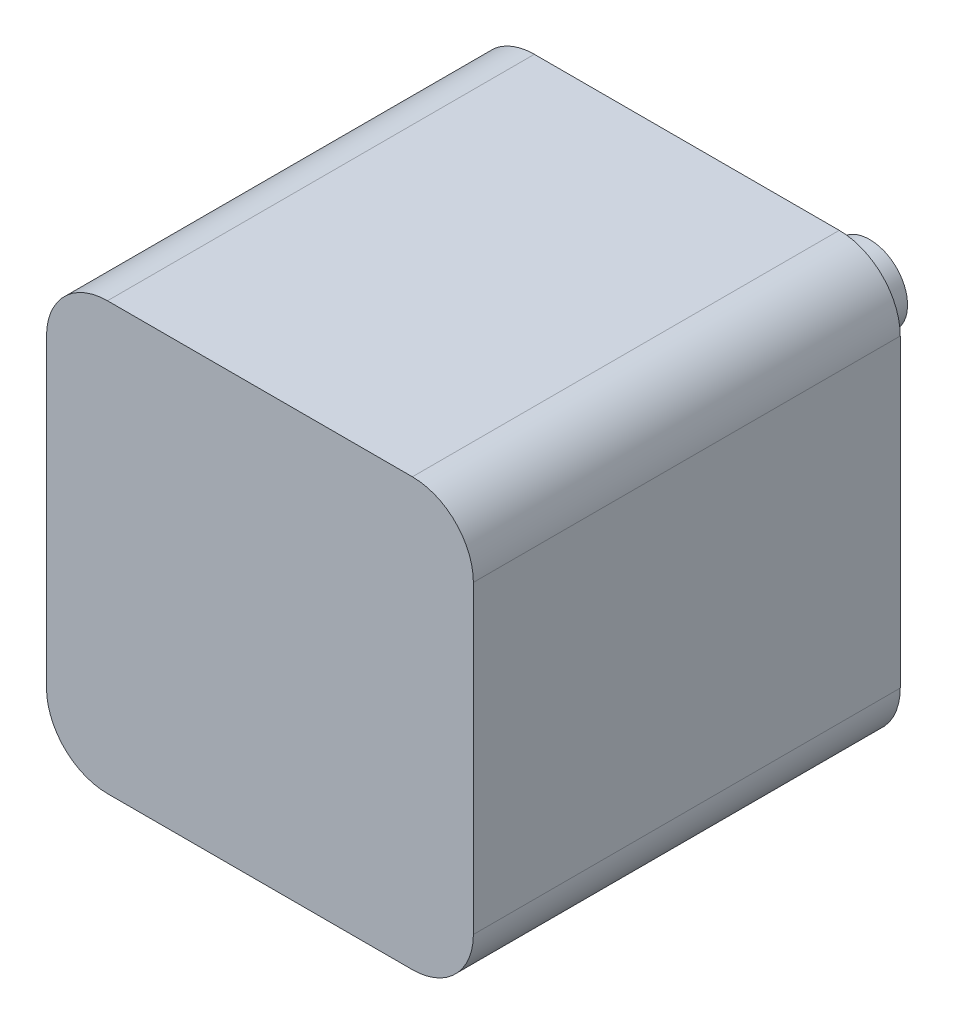
ISO-10303-21;
HEADER;
FILE_DESCRIPTION(('STEP AP214'),'2;1');
FILE_NAME('part.step','',(''),(''),'','','');
FILE_SCHEMA(('AUTOMOTIVE_DESIGN { 1 0 10303 214 1 1 1 1 }'));
ENDSEC;
DATA;
#1=APPLICATION_CONTEXT('core data for automotive mechanical design processes');
#2=APPLICATION_PROTOCOL_DEFINITION('international standard','automotive_design',2000,#1);
#3=PRODUCT_CONTEXT('',#1,'mechanical');
#4=PRODUCT('Part','Part','',(#3));
#5=PRODUCT_RELATED_PRODUCT_CATEGORY('part','',(#4));
#6=PRODUCT_DEFINITION_FORMATION('','',#4);
#7=PRODUCT_DEFINITION_CONTEXT('part definition',#1,'design');
#8=PRODUCT_DEFINITION('design','',#6,#7);
#9=PRODUCT_DEFINITION_SHAPE('','',#8);
#10=(LENGTH_UNIT() NAMED_UNIT(*) SI_UNIT(.MILLI.,.METRE.));
#11=(NAMED_UNIT(*) PLANE_ANGLE_UNIT() SI_UNIT($,.RADIAN.));
#12=(NAMED_UNIT(*) SI_UNIT($,.STERADIAN.) SOLID_ANGLE_UNIT());
#13=UNCERTAINTY_MEASURE_WITH_UNIT(LENGTH_MEASURE(1.E-05),#10,'distance_accuracy_value','');
#14=(GEOMETRIC_REPRESENTATION_CONTEXT(3) GLOBAL_UNCERTAINTY_ASSIGNED_CONTEXT((#13)) GLOBAL_UNIT_ASSIGNED_CONTEXT((#10,
#11,#12)) REPRESENTATION_CONTEXT('',''));
#15=CARTESIAN_POINT('',(0.,0.,0.));
#16=DIRECTION('',(0.,0.,1.));
#17=DIRECTION('',(1.,0.,0.));
#18=AXIS2_PLACEMENT_3D('',#15,#16,#17);
#19=CARTESIAN_POINT('',(8.89,-8.89,17.78));
#20=DIRECTION('',(-1.,0.,0.));
#21=DIRECTION('',(0.,0.,1.));
#22=AXIS2_PLACEMENT_3D('',#19,#20,#21);
#23=PLANE('',#22);
#24=DIRECTION('',(0.,1.,0.));
#25=VECTOR('',#24,1.);
#26=CARTESIAN_POINT('',(8.89,-8.89,17.78));
#27=LINE('',#26,#25);
#28=CARTESIAN_POINT('',(8.89,-6.35,17.78));
#29=VERTEX_POINT('',#28);
#30=CARTESIAN_POINT('',(8.89,6.34999999999999,17.78));
#31=VERTEX_POINT('',#30);
#32=EDGE_CURVE('E126',#29,#31,#27,.T.);
#33=ORIENTED_EDGE('',*,*,#32,.F.);
#34=DIRECTION('',(0.,0.,-1.));
#35=VECTOR('',#34,1.);
#36=CARTESIAN_POINT('',(8.89,-6.35,17.78));
#37=LINE('',#36,#35);
#38=CARTESIAN_POINT('',(8.89,-6.35,0.));
#39=VERTEX_POINT('',#38);
#40=EDGE_CURVE('E110',#29,#39,#37,.T.);
#41=ORIENTED_EDGE('',*,*,#40,.T.);
#42=DIRECTION('',(0.,1.,0.));
#43=VECTOR('',#42,1.);
#44=CARTESIAN_POINT('',(8.89,-8.89,0.));
#45=LINE('',#44,#43);
#46=CARTESIAN_POINT('',(8.89,6.34999999999999,0.));
#47=VERTEX_POINT('',#46);
#48=EDGE_CURVE('E123',#39,#47,#45,.T.);
#49=ORIENTED_EDGE('',*,*,#48,.T.);
#50=DIRECTION('',(0.,0.,-1.));
#51=VECTOR('',#50,1.);
#52=CARTESIAN_POINT('',(8.89,6.34999999999999,17.78));
#53=LINE('',#52,#51);
#54=EDGE_CURVE('E129',#47,#31,#53,.F.);
#55=ORIENTED_EDGE('',*,*,#54,.T.);
#56=EDGE_LOOP('',(#33,#41,#49,#55));
#57=FACE_BOUND('',#56,.T.);
#58=ADVANCED_FACE('F39',(#57),#23,.F.);
#59=CARTESIAN_POINT('',(-8.89,8.89,17.78));
#60=DIRECTION('',(0.,-1.,0.));
#61=DIRECTION('',(0.,0.,-1.));
#62=AXIS2_PLACEMENT_3D('',#59,#60,#61);
#63=PLANE('',#62);
#64=DIRECTION('',(-1.,0.,0.));
#65=VECTOR('',#64,1.);
#66=CARTESIAN_POINT('',(-8.89,8.89,0.));
#67=LINE('',#66,#65);
#68=CARTESIAN_POINT('',(6.35,8.89,0.));
#69=VERTEX_POINT('',#68);
#70=CARTESIAN_POINT('',(-6.35,8.89,0.));
#71=VERTEX_POINT('',#70);
#72=EDGE_CURVE('E134',#69,#71,#67,.T.);
#73=ORIENTED_EDGE('',*,*,#72,.T.);
#74=DIRECTION('',(0.,0.,-1.));
#75=VECTOR('',#74,1.);
#76=CARTESIAN_POINT('',(-6.35,8.89,17.78));
#77=LINE('',#76,#75);
#78=CARTESIAN_POINT('',(-6.35,8.89,17.78));
#79=VERTEX_POINT('',#78);
#80=EDGE_CURVE('E11',#71,#79,#77,.F.);
#81=ORIENTED_EDGE('',*,*,#80,.T.);
#82=DIRECTION('',(-1.,0.,0.));
#83=VECTOR('',#82,1.);
#84=CARTESIAN_POINT('',(-8.89,8.89,17.78));
#85=LINE('',#84,#83);
#86=CARTESIAN_POINT('',(6.35,8.89,17.78));
#87=VERTEX_POINT('',#86);
#88=EDGE_CURVE('E191',#87,#79,#85,.T.);
#89=ORIENTED_EDGE('',*,*,#88,.F.);
#90=DIRECTION('',(0.,0.,-1.));
#91=VECTOR('',#90,1.);
#92=CARTESIAN_POINT('',(6.35,8.89,17.78));
#93=LINE('',#92,#91);
#94=EDGE_CURVE('E48',#87,#69,#93,.T.);
#95=ORIENTED_EDGE('',*,*,#94,.T.);
#96=EDGE_LOOP('',(#73,#81,#89,#95));
#97=FACE_BOUND('',#96,.T.);
#98=ADVANCED_FACE('F189',(#97),#63,.F.);
#99=CARTESIAN_POINT('',(-8.89,-8.89,17.78));
#100=DIRECTION('',(1.,0.,0.));
#101=DIRECTION('',(0.,0.,-1.));
#102=AXIS2_PLACEMENT_3D('',#99,#100,#101);
#103=PLANE('',#102);
#104=DIRECTION('',(0.,-1.,0.));
#105=VECTOR('',#104,1.);
#106=CARTESIAN_POINT('',(-8.89,-8.89,0.));
#107=LINE('',#106,#105);
#108=CARTESIAN_POINT('',(-8.89,6.34999999999999,0.));
#109=VERTEX_POINT('',#108);
#110=CARTESIAN_POINT('',(-8.89,-6.35,0.));
#111=VERTEX_POINT('',#110);
#112=EDGE_CURVE('E140',#109,#111,#107,.T.);
#113=ORIENTED_EDGE('',*,*,#112,.T.);
#114=DIRECTION('',(0.,0.,-1.));
#115=VECTOR('',#114,1.);
#116=CARTESIAN_POINT('',(-8.89,-6.35,17.78));
#117=LINE('',#116,#115);
#118=CARTESIAN_POINT('',(-8.89,-6.35,17.78));
#119=VERTEX_POINT('',#118);
#120=EDGE_CURVE('E55',#111,#119,#117,.F.);
#121=ORIENTED_EDGE('',*,*,#120,.T.);
#122=DIRECTION('',(0.,-1.,0.));
#123=VECTOR('',#122,1.);
#124=CARTESIAN_POINT('',(-8.89,-8.89,17.78));
#125=LINE('',#124,#123);
#126=CARTESIAN_POINT('',(-8.89,6.34999999999999,17.78));
#127=VERTEX_POINT('',#126);
#128=EDGE_CURVE('E199',#127,#119,#125,.T.);
#129=ORIENTED_EDGE('',*,*,#128,.F.);
#130=DIRECTION('',(0.,0.,-1.));
#131=VECTOR('',#130,1.);
#132=CARTESIAN_POINT('',(-8.89,6.34999999999999,17.78));
#133=LINE('',#132,#131);
#134=EDGE_CURVE('E179',#127,#109,#133,.T.);
#135=ORIENTED_EDGE('',*,*,#134,.T.);
#136=EDGE_LOOP('',(#113,#121,#129,#135));
#137=FACE_BOUND('',#136,.T.);
#138=ADVANCED_FACE('F198',(#137),#103,.F.);
#139=CARTESIAN_POINT('',(-8.89,-8.89,17.78));
#140=DIRECTION('',(0.,1.,0.));
#141=DIRECTION('',(0.,0.,1.));
#142=AXIS2_PLACEMENT_3D('',#139,#140,#141);
#143=PLANE('',#142);
#144=DIRECTION('',(1.,0.,0.));
#145=VECTOR('',#144,1.);
#146=CARTESIAN_POINT('',(-8.89,-8.89,0.));
#147=LINE('',#146,#145);
#148=CARTESIAN_POINT('',(-6.35,-8.89,0.));
#149=VERTEX_POINT('',#148);
#150=CARTESIAN_POINT('',(6.35,-8.89,0.));
#151=VERTEX_POINT('',#150);
#152=EDGE_CURVE('E151',#149,#151,#147,.T.);
#153=ORIENTED_EDGE('',*,*,#152,.T.);
#154=DIRECTION('',(0.,0.,-1.));
#155=VECTOR('',#154,1.);
#156=CARTESIAN_POINT('',(6.35,-8.89,17.78));
#157=LINE('',#156,#155);
#158=CARTESIAN_POINT('',(6.35,-8.89,17.78));
#159=VERTEX_POINT('',#158);
#160=EDGE_CURVE('E111',#151,#159,#157,.F.);
#161=ORIENTED_EDGE('',*,*,#160,.T.);
#162=DIRECTION('',(1.,0.,0.));
#163=VECTOR('',#162,1.);
#164=CARTESIAN_POINT('',(-8.89,-8.89,17.78));
#165=LINE('',#164,#163);
#166=CARTESIAN_POINT('',(-6.35,-8.89,17.78));
#167=VERTEX_POINT('',#166);
#168=EDGE_CURVE('E146',#167,#159,#165,.T.);
#169=ORIENTED_EDGE('',*,*,#168,.F.);
#170=DIRECTION('',(0.,0.,-1.));
#171=VECTOR('',#170,1.);
#172=CARTESIAN_POINT('',(-6.35,-8.89,17.78));
#173=LINE('',#172,#171);
#174=EDGE_CURVE('E117',#167,#149,#173,.T.);
#175=ORIENTED_EDGE('',*,*,#174,.T.);
#176=EDGE_LOOP('',(#153,#161,#169,#175));
#177=FACE_BOUND('',#176,.T.);
#178=ADVANCED_FACE('F224',(#177),#143,.F.);
#179=CARTESIAN_POINT('',(0.,0.,17.78));
#180=DIRECTION('',(0.,0.,-1.));
#181=DIRECTION('',(-1.,0.,0.));
#182=AXIS2_PLACEMENT_3D('',#179,#180,#181);
#183=PLANE('',#182);
#184=ORIENTED_EDGE('',*,*,#168,.T.);
#185=CARTESIAN_POINT('',(6.35,-6.35,17.78));
#186=DIRECTION('',(0.,0.,-1.));
#187=DIRECTION('',(-1.,0.,0.));
#188=AXIS2_PLACEMENT_3D('',#185,#186,#187);
#189=CIRCLE('',#188,2.54);
#190=EDGE_CURVE('E176',#159,#29,#189,.F.);
#191=ORIENTED_EDGE('',*,*,#190,.T.);
#192=ORIENTED_EDGE('',*,*,#32,.T.);
#193=CARTESIAN_POINT('',(6.35,6.34999999999999,17.78));
#194=DIRECTION('',(0.,0.,-1.));
#195=DIRECTION('',(-1.,0.,0.));
#196=AXIS2_PLACEMENT_3D('',#193,#194,#195);
#197=CIRCLE('',#196,2.54);
#198=EDGE_CURVE('E168',#31,#87,#197,.F.);
#199=ORIENTED_EDGE('',*,*,#198,.T.);
#200=ORIENTED_EDGE('',*,*,#88,.T.);
#201=CARTESIAN_POINT('',(-6.35,6.34999999999999,17.78));
#202=DIRECTION('',(0.,0.,-1.));
#203=DIRECTION('',(-1.,0.,0.));
#204=AXIS2_PLACEMENT_3D('',#201,#202,#203);
#205=CIRCLE('',#204,2.54);
#206=EDGE_CURVE('E62',#79,#127,#205,.F.);
#207=ORIENTED_EDGE('',*,*,#206,.T.);
#208=ORIENTED_EDGE('',*,*,#128,.T.);
#209=CARTESIAN_POINT('',(-6.35,-6.35,17.78));
#210=DIRECTION('',(0.,0.,-1.));
#211=DIRECTION('',(-1.,0.,0.));
#212=AXIS2_PLACEMENT_3D('',#209,#210,#211);
#213=CIRCLE('',#212,2.54);
#214=EDGE_CURVE('E173',#119,#167,#213,.F.);
#215=ORIENTED_EDGE('',*,*,#214,.T.);
#216=EDGE_LOOP('',(#184,#191,#192,#199,#200,#207,#208,#215));
#217=FACE_BOUND('',#216,.T.);
#218=ADVANCED_FACE('F216',(#217),#183,.F.);
#219=CARTESIAN_POINT('',(0.,0.,0.));
#220=DIRECTION('',(0.,0.,-1.));
#221=DIRECTION('',(-1.,0.,0.));
#222=AXIS2_PLACEMENT_3D('',#219,#220,#221);
#223=PLANE('',#222);
#224=CARTESIAN_POINT('',(0.,0.,0.));
#225=DIRECTION('',(0.,0.,-1.));
#226=DIRECTION('',(-1.,0.,0.));
#227=AXIS2_PLACEMENT_3D('',#224,#225,#226);
#228=CIRCLE('',#227,1.57444428761994);
#229=CARTESIAN_POINT('',(-1.57444428761994,0.,0.));
#230=VERTEX_POINT('',#229);
#231=EDGE_CURVE('E143',#230,#230,#228,.T.);
#232=ORIENTED_EDGE('',*,*,#231,.F.);
#233=EDGE_LOOP('',(#232));
#234=FACE_BOUND('',#233,.T.);
#235=ORIENTED_EDGE('',*,*,#48,.F.);
#236=CARTESIAN_POINT('',(6.35,-6.35,0.));
#237=DIRECTION('',(0.,0.,-1.));
#238=DIRECTION('',(-1.,0.,0.));
#239=AXIS2_PLACEMENT_3D('',#236,#237,#238);
#240=CIRCLE('',#239,2.54);
#241=EDGE_CURVE('E106',#39,#151,#240,.T.);
#242=ORIENTED_EDGE('',*,*,#241,.T.);
#243=ORIENTED_EDGE('',*,*,#152,.F.);
#244=CARTESIAN_POINT('',(-6.35,-6.35,0.));
#245=DIRECTION('',(0.,0.,-1.));
#246=DIRECTION('',(-1.,0.,0.));
#247=AXIS2_PLACEMENT_3D('',#244,#245,#246);
#248=CIRCLE('',#247,2.54);
#249=EDGE_CURVE('E118',#149,#111,#248,.T.);
#250=ORIENTED_EDGE('',*,*,#249,.T.);
#251=ORIENTED_EDGE('',*,*,#112,.F.);
#252=CARTESIAN_POINT('',(-6.35,6.34999999999999,0.));
#253=DIRECTION('',(0.,0.,-1.));
#254=DIRECTION('',(-1.,0.,0.));
#255=AXIS2_PLACEMENT_3D('',#252,#253,#254);
#256=CIRCLE('',#255,2.54);
#257=EDGE_CURVE('E158',#109,#71,#256,.T.);
#258=ORIENTED_EDGE('',*,*,#257,.T.);
#259=ORIENTED_EDGE('',*,*,#72,.F.);
#260=CARTESIAN_POINT('',(6.35,6.34999999999999,0.));
#261=DIRECTION('',(0.,0.,-1.));
#262=DIRECTION('',(-1.,0.,0.));
#263=AXIS2_PLACEMENT_3D('',#260,#261,#262);
#264=CIRCLE('',#263,2.54);
#265=EDGE_CURVE('E128',#69,#47,#264,.T.);
#266=ORIENTED_EDGE('',*,*,#265,.T.);
#267=EDGE_LOOP('',(#235,#242,#243,#250,#251,#258,#259,#266));
#268=FACE_BOUND('',#267,.T.);
#269=ADVANCED_FACE('F131',(#234,#268),#223,.T.);
#270=CARTESIAN_POINT('',(6.35,-6.35,17.78));
#271=DIRECTION('',(0.,0.,-1.));
#272=DIRECTION('',(-1.,0.,0.));
#273=AXIS2_PLACEMENT_3D('',#270,#271,#272);
#274=CYLINDRICAL_SURFACE('',#273,2.54);
#275=ORIENTED_EDGE('',*,*,#190,.F.);
#276=ORIENTED_EDGE('',*,*,#160,.F.);
#277=ORIENTED_EDGE('',*,*,#241,.F.);
#278=ORIENTED_EDGE('',*,*,#40,.F.);
#279=EDGE_LOOP('',(#275,#276,#277,#278));
#280=FACE_BOUND('',#279,.T.);
#281=ADVANCED_FACE('F109',(#280),#274,.T.);
#282=CARTESIAN_POINT('',(-6.35,-6.35,17.78));
#283=DIRECTION('',(0.,0.,-1.));
#284=DIRECTION('',(-1.,0.,0.));
#285=AXIS2_PLACEMENT_3D('',#282,#283,#284);
#286=CYLINDRICAL_SURFACE('',#285,2.54);
#287=ORIENTED_EDGE('',*,*,#214,.F.);
#288=ORIENTED_EDGE('',*,*,#120,.F.);
#289=ORIENTED_EDGE('',*,*,#249,.F.);
#290=ORIENTED_EDGE('',*,*,#174,.F.);
#291=EDGE_LOOP('',(#287,#288,#289,#290));
#292=FACE_BOUND('',#291,.T.);
#293=ADVANCED_FACE('F222',(#292),#286,.T.);
#294=CARTESIAN_POINT('',(-6.35,6.34999999999999,17.78));
#295=DIRECTION('',(0.,0.,-1.));
#296=DIRECTION('',(-1.,0.,0.));
#297=AXIS2_PLACEMENT_3D('',#294,#295,#296);
#298=CYLINDRICAL_SURFACE('',#297,2.54);
#299=ORIENTED_EDGE('',*,*,#206,.F.);
#300=ORIENTED_EDGE('',*,*,#80,.F.);
#301=ORIENTED_EDGE('',*,*,#257,.F.);
#302=ORIENTED_EDGE('',*,*,#134,.F.);
#303=EDGE_LOOP('',(#299,#300,#301,#302));
#304=FACE_BOUND('',#303,.T.);
#305=ADVANCED_FACE('F197',(#304),#298,.T.);
#306=CARTESIAN_POINT('',(6.35,6.34999999999999,17.78));
#307=DIRECTION('',(0.,0.,-1.));
#308=DIRECTION('',(-1.,0.,0.));
#309=AXIS2_PLACEMENT_3D('',#306,#307,#308);
#310=CYLINDRICAL_SURFACE('',#309,2.54);
#311=ORIENTED_EDGE('',*,*,#198,.F.);
#312=ORIENTED_EDGE('',*,*,#54,.F.);
#313=ORIENTED_EDGE('',*,*,#265,.F.);
#314=ORIENTED_EDGE('',*,*,#94,.F.);
#315=EDGE_LOOP('',(#311,#312,#313,#314));
#316=FACE_BOUND('',#315,.T.);
#317=ADVANCED_FACE('F41',(#316),#310,.T.);
#318=CARTESIAN_POINT('',(0.,0.,-7.61999999999999));
#319=DIRECTION('',(0.,0.,1.));
#320=DIRECTION('',(1.,0.,0.));
#321=AXIS2_PLACEMENT_3D('',#318,#319,#320);
#322=CYLINDRICAL_SURFACE('',#321,1.57444428761994);
#323=CARTESIAN_POINT('',(0.,0.,-7.61999999999999));
#324=DIRECTION('',(0.,0.,-1.));
#325=DIRECTION('',(-1.,0.,0.));
#326=AXIS2_PLACEMENT_3D('',#323,#324,#325);
#327=CIRCLE('',#326,1.57444428761994);
#328=CARTESIAN_POINT('',(-1.57444428761994,0.,-7.61999999999999));
#329=VERTEX_POINT('',#328);
#330=EDGE_CURVE('E135',#329,#329,#327,.T.);
#331=ORIENTED_EDGE('',*,*,#330,.F.);
#332=EDGE_LOOP('',(#331));
#333=FACE_BOUND('',#332,.T.);
#334=ORIENTED_EDGE('',*,*,#231,.T.);
#335=EDGE_LOOP('',(#334));
#336=FACE_BOUND('',#335,.T.);
#337=ADVANCED_FACE('F213',(#333,#336),#322,.T.);
#338=CARTESIAN_POINT('',(0.,0.,-7.61999999999999));
#339=DIRECTION('',(0.,0.,-1.));
#340=DIRECTION('',(-1.,0.,0.));
#341=AXIS2_PLACEMENT_3D('',#338,#339,#340);
#342=PLANE('',#341);
#343=ORIENTED_EDGE('',*,*,#330,.T.);
#344=EDGE_LOOP('',(#343));
#345=FACE_BOUND('',#344,.T.);
#346=ADVANCED_FACE('F244',(#345),#342,.T.);
#347=CLOSED_SHELL('',(#58,#98,#138,#178,#218,#269,#281,#293,#305,#317,#337,#346));
#348=MANIFOLD_SOLID_BREP('B2',#347);
#349=ADVANCED_BREP_SHAPE_REPRESENTATION('',(#18,#348),#14);
#350=SHAPE_DEFINITION_REPRESENTATION(#9,#349);
ENDSEC;
END-ISO-10303-21;
